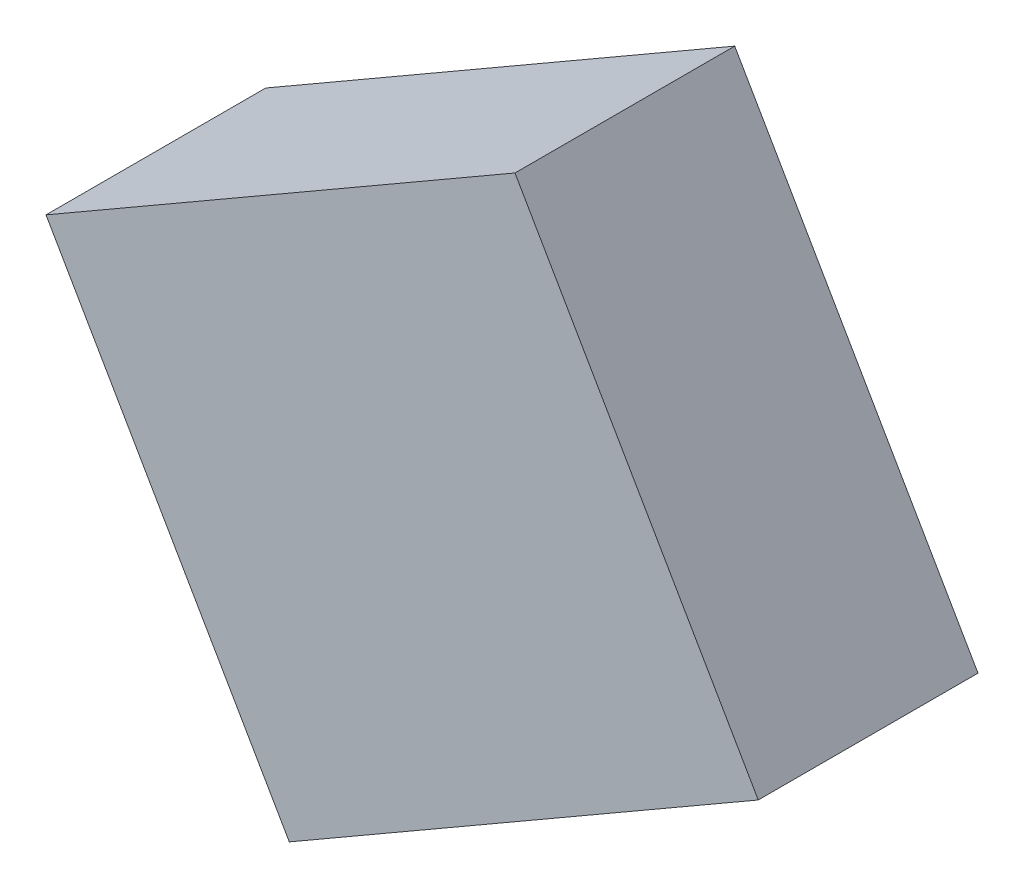
ISO-10303-21;
HEADER;
FILE_DESCRIPTION(('STEP AP214'),'2;1');
FILE_NAME('part.step','',(''),(''),'','','');
FILE_SCHEMA(('AUTOMOTIVE_DESIGN { 1 0 10303 214 1 1 1 1 }'));
ENDSEC;
DATA;
#1=APPLICATION_CONTEXT('core data for automotive mechanical design processes');
#2=APPLICATION_PROTOCOL_DEFINITION('international standard','automotive_design',2000,#1);
#3=PRODUCT_CONTEXT('',#1,'mechanical');
#4=PRODUCT('Part','Part','',(#3));
#5=PRODUCT_RELATED_PRODUCT_CATEGORY('part','',(#4));
#6=PRODUCT_DEFINITION_FORMATION('','',#4);
#7=PRODUCT_DEFINITION_CONTEXT('part definition',#1,'design');
#8=PRODUCT_DEFINITION('design','',#6,#7);
#9=PRODUCT_DEFINITION_SHAPE('','',#8);
#10=(LENGTH_UNIT() NAMED_UNIT(*) SI_UNIT(.MILLI.,.METRE.));
#11=(NAMED_UNIT(*) PLANE_ANGLE_UNIT() SI_UNIT($,.RADIAN.));
#12=(NAMED_UNIT(*) SI_UNIT($,.STERADIAN.) SOLID_ANGLE_UNIT());
#13=UNCERTAINTY_MEASURE_WITH_UNIT(LENGTH_MEASURE(1.E-05),#10,'distance_accuracy_value','');
#14=(GEOMETRIC_REPRESENTATION_CONTEXT(3) GLOBAL_UNCERTAINTY_ASSIGNED_CONTEXT((#13)) GLOBAL_UNIT_ASSIGNED_CONTEXT((#10,
#11,#12)) REPRESENTATION_CONTEXT('',''));
#15=CARTESIAN_POINT('',(0.,0.,0.));
#16=DIRECTION('',(0.,0.,1.));
#17=DIRECTION('',(1.,0.,0.));
#18=AXIS2_PLACEMENT_3D('',#15,#16,#17);
#19=CARTESIAN_POINT('',(2.2688931,-0.47983902,1.39999974));
#20=DIRECTION('',(0.,0.,-1.));
#21=DIRECTION('',(-1.,0.,0.));
#22=AXIS2_PLACEMENT_3D('',#19,#20,#21);
#23=PLANE('',#22);
#24=DIRECTION('',(0.866025294610955,0.500000189093974,0.));
#25=VECTOR('',#24,1.);
#26=CARTESIAN_POINT('',(0.71889366,2.20483938,1.39999974));
#27=LINE('',#26,#25);
#28=CARTESIAN_POINT('',(0.718893659999855,2.20483937999992,1.39999974));
#29=VERTEX_POINT('',#28);
#30=CARTESIAN_POINT('',(-2.26889310000007,0.479839020000115,1.39999974));
#31=VERTEX_POINT('',#30);
#32=EDGE_CURVE('E54',#29,#31,#27,.F.);
#33=ORIENTED_EDGE('',*,*,#32,.T.);
#34=DIRECTION('',(-0.499999913646723,0.866025453640521,0.));
#35=VECTOR('',#34,1.);
#36=CARTESIAN_POINT('',(-2.2688931,0.47983902,1.39999974));
#37=LINE('',#36,#35);
#38=CARTESIAN_POINT('',(-0.718893659999855,-2.20483937999992,1.39999974));
#39=VERTEX_POINT('',#38);
#40=EDGE_CURVE('E56',#31,#39,#37,.F.);
#41=ORIENTED_EDGE('',*,*,#40,.T.);
#42=DIRECTION('',(-0.866025294610955,-0.500000189093974,0.));
#43=VECTOR('',#42,1.);
#44=CARTESIAN_POINT('',(-0.71889366,-2.20483938,1.39999974));
#45=LINE('',#44,#43);
#46=CARTESIAN_POINT('',(2.26889310000013,-0.47983902000023,1.39999974));
#47=VERTEX_POINT('',#46);
#48=EDGE_CURVE('E19',#39,#47,#45,.F.);
#49=ORIENTED_EDGE('',*,*,#48,.T.);
#50=DIRECTION('',(0.499999913646723,-0.866025453640521,0.));
#51=VECTOR('',#50,1.);
#52=CARTESIAN_POINT('',(2.2688931,-0.47983902,1.39999974));
#53=LINE('',#52,#51);
#54=EDGE_CURVE('E79',#47,#29,#53,.F.);
#55=ORIENTED_EDGE('',*,*,#54,.T.);
#56=EDGE_LOOP('',(#33,#41,#49,#55));
#57=FACE_BOUND('',#56,.T.);
#58=ADVANCED_FACE('F16',(#57),#23,.F.);
#59=CARTESIAN_POINT('',(-0.71889366,-2.20483938,0.));
#60=DIRECTION('',(-0.500000189093974,0.866025294610955,0.));
#61=DIRECTION('',(-0.866025294610955,-0.500000189093974,0.));
#62=AXIS2_PLACEMENT_3D('',#59,#60,#61);
#63=PLANE('',#62);
#64=DIRECTION('',(0.,0.,1.));
#65=VECTOR('',#64,1.);
#66=CARTESIAN_POINT('',(2.2688931,-0.47983902,0.));
#67=LINE('',#66,#65);
#68=CARTESIAN_POINT('',(2.26889310000013,-0.47983902000023,0.));
#69=VERTEX_POINT('',#68);
#70=EDGE_CURVE('E67',#69,#47,#67,.T.);
#71=ORIENTED_EDGE('',*,*,#70,.T.);
#72=ORIENTED_EDGE('',*,*,#48,.F.);
#73=DIRECTION('',(0.,0.,1.));
#74=VECTOR('',#73,1.);
#75=CARTESIAN_POINT('',(-0.718893659999419,-2.20483937999967,0.));
#76=LINE('',#75,#74);
#77=CARTESIAN_POINT('',(-0.718893659999855,-2.20483937999992,0.));
#78=VERTEX_POINT('',#77);
#79=EDGE_CURVE('E62',#39,#78,#76,.F.);
#80=ORIENTED_EDGE('',*,*,#79,.T.);
#81=DIRECTION('',(-0.866025294610877,-0.500000189094107,0.));
#82=VECTOR('',#81,1.);
#83=CARTESIAN_POINT('',(2.2688931,-0.47983902,0.));
#84=LINE('',#83,#82);
#85=EDGE_CURVE('E82',#69,#78,#84,.T.);
#86=ORIENTED_EDGE('',*,*,#85,.F.);
#87=EDGE_LOOP('',(#71,#72,#80,#86));
#88=FACE_BOUND('',#87,.T.);
#89=ADVANCED_FACE('F64',(#88),#63,.F.);
#90=CARTESIAN_POINT('',(-2.2688931,0.47983902,0.));
#91=DIRECTION('',(0.866025453640521,0.499999913646723,0.));
#92=DIRECTION('',(-0.499999913646723,0.866025453640521,0.));
#93=AXIS2_PLACEMENT_3D('',#90,#91,#92);
#94=PLANE('',#93);
#95=ORIENTED_EDGE('',*,*,#79,.F.);
#96=ORIENTED_EDGE('',*,*,#40,.F.);
#97=DIRECTION('',(0.,0.,1.));
#98=VECTOR('',#97,1.);
#99=CARTESIAN_POINT('',(-2.26889310000027,0.47983902000046,0.));
#100=LINE('',#99,#98);
#101=CARTESIAN_POINT('',(-2.26889310000007,0.479839020000115,0.));
#102=VERTEX_POINT('',#101);
#103=EDGE_CURVE('E74',#31,#102,#100,.F.);
#104=ORIENTED_EDGE('',*,*,#103,.T.);
#105=DIRECTION('',(-0.499999913646536,0.866025453640629,0.));
#106=VECTOR('',#105,1.);
#107=CARTESIAN_POINT('',(-0.71889366,-2.20483938,0.));
#108=LINE('',#107,#106);
#109=EDGE_CURVE('E71',#78,#102,#108,.T.);
#110=ORIENTED_EDGE('',*,*,#109,.F.);
#111=EDGE_LOOP('',(#95,#96,#104,#110));
#112=FACE_BOUND('',#111,.T.);
#113=ADVANCED_FACE('F69',(#112),#94,.F.);
#114=CARTESIAN_POINT('',(0.71889366,2.20483938,0.));
#115=DIRECTION('',(0.500000189093974,-0.866025294610955,0.));
#116=DIRECTION('',(0.866025294610955,0.500000189093974,0.));
#117=AXIS2_PLACEMENT_3D('',#114,#115,#116);
#118=PLANE('',#117);
#119=ORIENTED_EDGE('',*,*,#103,.F.);
#120=ORIENTED_EDGE('',*,*,#32,.F.);
#121=DIRECTION('',(0.,0.,1.));
#122=VECTOR('',#121,1.);
#123=CARTESIAN_POINT('',(0.718893659999419,2.20483937999967,0.));
#124=LINE('',#123,#122);
#125=CARTESIAN_POINT('',(0.718893659999855,2.20483937999992,0.));
#126=VERTEX_POINT('',#125);
#127=EDGE_CURVE('E34',#29,#126,#124,.F.);
#128=ORIENTED_EDGE('',*,*,#127,.T.);
#129=DIRECTION('',(0.866025294610877,0.500000189094107,0.));
#130=VECTOR('',#129,1.);
#131=CARTESIAN_POINT('',(-2.2688931,0.47983902,0.));
#132=LINE('',#131,#130);
#133=EDGE_CURVE('E25',#102,#126,#132,.T.);
#134=ORIENTED_EDGE('',*,*,#133,.F.);
#135=EDGE_LOOP('',(#119,#120,#128,#134));
#136=FACE_BOUND('',#135,.T.);
#137=ADVANCED_FACE('F88',(#136),#118,.F.);
#138=CARTESIAN_POINT('',(2.2688931,-0.47983902,0.));
#139=DIRECTION('',(-0.866025453640521,-0.499999913646723,0.));
#140=DIRECTION('',(0.499999913646723,-0.866025453640521,0.));
#141=AXIS2_PLACEMENT_3D('',#138,#139,#140);
#142=PLANE('',#141);
#143=ORIENTED_EDGE('',*,*,#127,.F.);
#144=ORIENTED_EDGE('',*,*,#54,.F.);
#145=ORIENTED_EDGE('',*,*,#70,.F.);
#146=DIRECTION('',(0.499999913646536,-0.866025453640629,0.));
#147=VECTOR('',#146,1.);
#148=CARTESIAN_POINT('',(0.71889366,2.20483938,0.));
#149=LINE('',#148,#147);
#150=EDGE_CURVE('E11',#126,#69,#149,.T.);
#151=ORIENTED_EDGE('',*,*,#150,.F.);
#152=EDGE_LOOP('',(#143,#144,#145,#151));
#153=FACE_BOUND('',#152,.T.);
#154=ADVANCED_FACE('F90',(#153),#142,.F.);
#155=CARTESIAN_POINT('',(2.2688931,-0.47983902,0.));
#156=DIRECTION('',(0.,0.,-1.));
#157=DIRECTION('',(-1.,0.,0.));
#158=AXIS2_PLACEMENT_3D('',#155,#156,#157);
#159=PLANE('',#158);
#160=ORIENTED_EDGE('',*,*,#133,.T.);
#161=ORIENTED_EDGE('',*,*,#150,.T.);
#162=ORIENTED_EDGE('',*,*,#85,.T.);
#163=ORIENTED_EDGE('',*,*,#109,.T.);
#164=EDGE_LOOP('',(#160,#161,#162,#163));
#165=FACE_BOUND('',#164,.T.);
#166=ADVANCED_FACE('F87',(#165),#159,.T.);
#167=CLOSED_SHELL('',(#58,#89,#113,#137,#154,#166));
#168=MANIFOLD_SOLID_BREP('B1',#167);
#169=ADVANCED_BREP_SHAPE_REPRESENTATION('',(#18,#168),#14);
#170=SHAPE_DEFINITION_REPRESENTATION(#9,#169);
ENDSEC;
END-ISO-10303-21;
